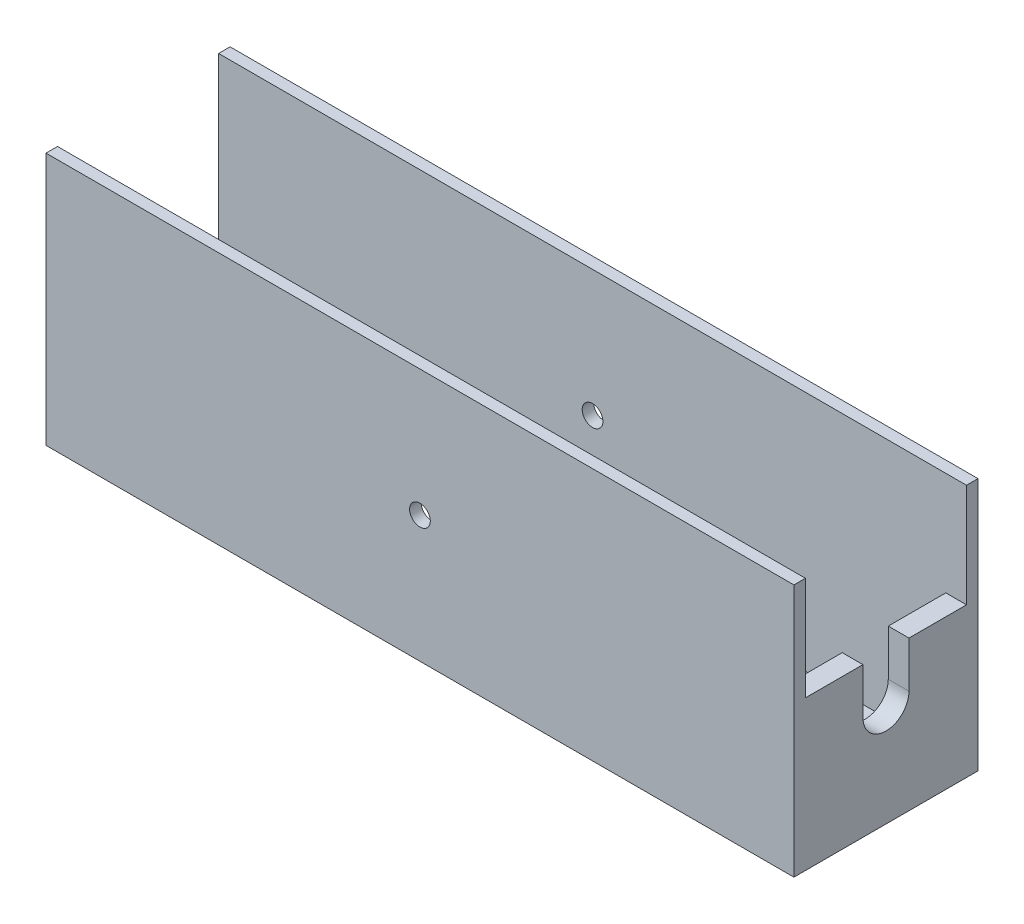
ISO-10303-21;
HEADER;
FILE_DESCRIPTION(('STEP AP214'),'2;1');
FILE_NAME('part.step','',(''),(''),'','','');
FILE_SCHEMA(('AUTOMOTIVE_DESIGN { 1 0 10303 214 1 1 1 1 }'));
ENDSEC;
DATA;
#1=APPLICATION_CONTEXT('core data for automotive mechanical design processes');
#2=APPLICATION_PROTOCOL_DEFINITION('international standard','automotive_design',2000,#1);
#3=PRODUCT_CONTEXT('',#1,'mechanical');
#4=PRODUCT('Part','Part','',(#3));
#5=PRODUCT_RELATED_PRODUCT_CATEGORY('part','',(#4));
#6=PRODUCT_DEFINITION_FORMATION('','',#4);
#7=PRODUCT_DEFINITION_CONTEXT('part definition',#1,'design');
#8=PRODUCT_DEFINITION('design','',#6,#7);
#9=PRODUCT_DEFINITION_SHAPE('','',#8);
#10=(LENGTH_UNIT() NAMED_UNIT(*) SI_UNIT(.MILLI.,.METRE.));
#11=(NAMED_UNIT(*) PLANE_ANGLE_UNIT() SI_UNIT($,.RADIAN.));
#12=(NAMED_UNIT(*) SI_UNIT($,.STERADIAN.) SOLID_ANGLE_UNIT());
#13=UNCERTAINTY_MEASURE_WITH_UNIT(LENGTH_MEASURE(1.E-05),#10,'distance_accuracy_value','');
#14=(GEOMETRIC_REPRESENTATION_CONTEXT(3) GLOBAL_UNCERTAINTY_ASSIGNED_CONTEXT((#13)) GLOBAL_UNIT_ASSIGNED_CONTEXT((#10,
#11,#12)) REPRESENTATION_CONTEXT('',''));
#15=CARTESIAN_POINT('',(0.,0.,0.));
#16=DIRECTION('',(0.,0.,1.));
#17=DIRECTION('',(1.,0.,0.));
#18=AXIS2_PLACEMENT_3D('',#15,#16,#17);
#19=CARTESIAN_POINT('',(0.,105.,0.));
#20=DIRECTION('',(0.,-1.,0.));
#21=DIRECTION('',(0.,0.,-1.));
#22=AXIS2_PLACEMENT_3D('',#19,#20,#21);
#23=PLANE('',#22);
#24=DIRECTION('',(-1.,0.,0.));
#25=VECTOR('',#24,1.);
#26=CARTESIAN_POINT('',(-150.609375415053,105.,-80.5076419213973));
#27=LINE('',#26,#25);
#28=CARTESIAN_POINT('',(162.5,105.,-80.5076419213973));
#29=VERTEX_POINT('',#28);
#30=CARTESIAN_POINT('',(-162.5,105.,-80.5076419213973));
#31=VERTEX_POINT('',#30);
#32=EDGE_CURVE('E48',#29,#31,#27,.T.);
#33=ORIENTED_EDGE('',*,*,#32,.F.);
#34=DIRECTION('',(0.,0.,1.));
#35=VECTOR('',#34,1.);
#36=CARTESIAN_POINT('',(162.5,105.,-85.5076419213973));
#37=LINE('',#36,#35);
#38=CARTESIAN_POINT('',(162.5,105.,-85.5076419213973));
#39=VERTEX_POINT('',#38);
#40=EDGE_CURVE('E238',#39,#29,#37,.T.);
#41=ORIENTED_EDGE('',*,*,#40,.F.);
#42=DIRECTION('',(1.,0.,0.));
#43=VECTOR('',#42,1.);
#44=CARTESIAN_POINT('',(-162.5,105.,-85.5076419213973));
#45=LINE('',#44,#43);
#46=CARTESIAN_POINT('',(-162.5,105.,-85.5076419213973));
#47=VERTEX_POINT('',#46);
#48=EDGE_CURVE('E234',#47,#39,#45,.T.);
#49=ORIENTED_EDGE('',*,*,#48,.F.);
#50=DIRECTION('',(0.,0.,-1.));
#51=VECTOR('',#50,1.);
#52=CARTESIAN_POINT('',(-162.5,105.,-80.5076419213973));
#53=LINE('',#52,#51);
#54=EDGE_CURVE('E230',#31,#47,#53,.T.);
#55=ORIENTED_EDGE('',*,*,#54,.F.);
#56=EDGE_LOOP('',(#33,#41,#49,#55));
#57=FACE_BOUND('',#56,.T.);
#58=ADVANCED_FACE('F33',(#57),#23,.F.);
#59=CARTESIAN_POINT('',(0.,0.,0.));
#60=DIRECTION('',(0.,-1.,0.));
#61=DIRECTION('',(0.,0.,-1.));
#62=AXIS2_PLACEMENT_3D('',#59,#60,#61);
#63=PLANE('',#62);
#64=DIRECTION('',(0.,0.,-1.));
#65=VECTOR('',#64,1.);
#66=CARTESIAN_POINT('',(-67.5,0.,-10.5076419213973));
#67=LINE('',#66,#65);
#68=CARTESIAN_POINT('',(-67.5,0.,-10.5076419213973));
#69=VERTEX_POINT('',#68);
#70=CARTESIAN_POINT('',(-67.5,0.,-80.5076419213973));
#71=VERTEX_POINT('',#70);
#72=EDGE_CURVE('E208',#69,#71,#67,.T.);
#73=ORIENTED_EDGE('',*,*,#72,.T.);
#74=DIRECTION('',(1.,0.,0.));
#75=VECTOR('',#74,1.);
#76=CARTESIAN_POINT('',(-150.609375415053,0.,-80.5076419213973));
#77=LINE('',#76,#75);
#78=CARTESIAN_POINT('',(-162.5,0.,-80.5076419213973));
#79=VERTEX_POINT('',#78);
#80=EDGE_CURVE('E231',#79,#71,#77,.T.);
#81=ORIENTED_EDGE('',*,*,#80,.F.);
#82=DIRECTION('',(0.,0.,1.));
#83=VECTOR('',#82,1.);
#84=CARTESIAN_POINT('',(-162.5,0.,-5.50764192139734));
#85=LINE('',#84,#83);
#86=CARTESIAN_POINT('',(-162.5,0.,-10.5076419213973));
#87=VERTEX_POINT('',#86);
#88=EDGE_CURVE('E261',#79,#87,#85,.T.);
#89=ORIENTED_EDGE('',*,*,#88,.T.);
#90=DIRECTION('',(1.,0.,0.));
#91=VECTOR('',#90,1.);
#92=CARTESIAN_POINT('',(-150.609375415053,0.,-10.5076419213973));
#93=LINE('',#92,#91);
#94=EDGE_CURVE('E250',#87,#69,#93,.T.);
#95=ORIENTED_EDGE('',*,*,#94,.T.);
#96=EDGE_LOOP('',(#73,#81,#89,#95));
#97=FACE_BOUND('',#96,.T.);
#98=ADVANCED_FACE('F352',(#97),#63,.F.);
#99=CARTESIAN_POINT('',(0.,-5.,0.));
#100=DIRECTION('',(0.,-1.,0.));
#101=DIRECTION('',(0.,0.,-1.));
#102=AXIS2_PLACEMENT_3D('',#99,#100,#101);
#103=PLANE('',#102);
#104=DIRECTION('',(0.,0.,-1.));
#105=VECTOR('',#104,1.);
#106=CARTESIAN_POINT('',(162.5,-5.,-5.50764192139734));
#107=LINE('',#106,#105);
#108=CARTESIAN_POINT('',(162.5,-5.,-5.50764192139734));
#109=VERTEX_POINT('',#108);
#110=CARTESIAN_POINT('',(162.5,-5.,-85.5076419213973));
#111=VERTEX_POINT('',#110);
#112=EDGE_CURVE('E268',#109,#111,#107,.T.);
#113=ORIENTED_EDGE('',*,*,#112,.F.);
#114=DIRECTION('',(1.,0.,0.));
#115=VECTOR('',#114,1.);
#116=CARTESIAN_POINT('',(-162.5,-5.,-5.50764192139734));
#117=LINE('',#116,#115);
#118=CARTESIAN_POINT('',(-162.5,-5.,-5.50764192139734));
#119=VERTEX_POINT('',#118);
#120=EDGE_CURVE('E277',#119,#109,#117,.T.);
#121=ORIENTED_EDGE('',*,*,#120,.F.);
#122=DIRECTION('',(0.,0.,1.));
#123=VECTOR('',#122,1.);
#124=CARTESIAN_POINT('',(-162.5,-5.,-5.50764192139734));
#125=LINE('',#124,#123);
#126=CARTESIAN_POINT('',(-162.5,-5.,-85.5076419213973));
#127=VERTEX_POINT('',#126);
#128=EDGE_CURVE('E274',#127,#119,#125,.T.);
#129=ORIENTED_EDGE('',*,*,#128,.F.);
#130=DIRECTION('',(-1.,0.,0.));
#131=VECTOR('',#130,1.);
#132=CARTESIAN_POINT('',(-162.5,-5.,-85.5076419213973));
#133=LINE('',#132,#131);
#134=EDGE_CURVE('E271',#111,#127,#133,.T.);
#135=ORIENTED_EDGE('',*,*,#134,.F.);
#136=EDGE_LOOP('',(#113,#121,#129,#135));
#137=FACE_BOUND('',#136,.T.);
#138=DIRECTION('',(0.,0.,1.));
#139=VECTOR('',#138,1.);
#140=CARTESIAN_POINT('',(52.5,-5.,0.));
#141=LINE('',#140,#139);
#142=CARTESIAN_POINT('',(52.5,-5.,-80.5076419213973));
#143=VERTEX_POINT('',#142);
#144=CARTESIAN_POINT('',(52.5,-5.,-10.5076419213973));
#145=VERTEX_POINT('',#144);
#146=EDGE_CURVE('E298',#143,#145,#141,.T.);
#147=ORIENTED_EDGE('',*,*,#146,.F.);
#148=DIRECTION('',(-1.,0.,0.));
#149=VECTOR('',#148,1.);
#150=CARTESIAN_POINT('',(0.,-5.,-80.5076419213973));
#151=LINE('',#150,#149);
#152=CARTESIAN_POINT('',(-67.5,-5.,-80.5076419213973));
#153=VERTEX_POINT('',#152);
#154=EDGE_CURVE('E300',#143,#153,#151,.T.);
#155=ORIENTED_EDGE('',*,*,#154,.T.);
#156=DIRECTION('',(0.,0.,1.));
#157=VECTOR('',#156,1.);
#158=CARTESIAN_POINT('',(-67.5,-5.,0.));
#159=LINE('',#158,#157);
#160=CARTESIAN_POINT('',(-67.5,-5.,-10.5076419213973));
#161=VERTEX_POINT('',#160);
#162=EDGE_CURVE('E286',#153,#161,#159,.T.);
#163=ORIENTED_EDGE('',*,*,#162,.T.);
#164=DIRECTION('',(-1.,0.,0.));
#165=VECTOR('',#164,1.);
#166=CARTESIAN_POINT('',(0.,-5.,-10.5076419213973));
#167=LINE('',#166,#165);
#168=EDGE_CURVE('E296',#145,#161,#167,.T.);
#169=ORIENTED_EDGE('',*,*,#168,.F.);
#170=EDGE_LOOP('',(#147,#155,#163,#169));
#171=FACE_BOUND('',#170,.T.);
#172=ADVANCED_FACE('F336',(#137,#171),#103,.T.);
#173=CARTESIAN_POINT('',(52.5,0.,-80.5076419213973));
#174=VERTEX_POINT('',#173);
#175=CARTESIAN_POINT('',(153.5,0.,-80.5076419213973));
#176=VERTEX_POINT('',#175);
#177=EDGE_CURVE('E256',#174,#176,#77,.T.);
#178=ORIENTED_EDGE('',*,*,#177,.F.);
#179=DIRECTION('',(0.,0.,-1.));
#180=VECTOR('',#179,1.);
#181=CARTESIAN_POINT('',(52.5,0.,-10.5076419213973));
#182=LINE('',#181,#180);
#183=CARTESIAN_POINT('',(52.5,0.,-10.5076419213973));
#184=VERTEX_POINT('',#183);
#185=EDGE_CURVE('E205',#184,#174,#182,.T.);
#186=ORIENTED_EDGE('',*,*,#185,.F.);
#187=CARTESIAN_POINT('',(153.5,0.,-10.5076419213973));
#188=VERTEX_POINT('',#187);
#189=EDGE_CURVE('E228',#184,#188,#93,.T.);
#190=ORIENTED_EDGE('',*,*,#189,.T.);
#191=DIRECTION('',(0.,0.,-1.));
#192=VECTOR('',#191,1.);
#193=CARTESIAN_POINT('',(153.5,0.,-10.5076419213973));
#194=LINE('',#193,#192);
#195=EDGE_CURVE('E253',#188,#176,#194,.T.);
#196=ORIENTED_EDGE('',*,*,#195,.T.);
#197=EDGE_LOOP('',(#178,#186,#190,#196));
#198=FACE_BOUND('',#197,.T.);
#199=ADVANCED_FACE('F364',(#198),#63,.F.);
#200=CARTESIAN_POINT('',(162.5,-5.,-5.50764192139734));
#201=DIRECTION('',(1.,0.,0.));
#202=DIRECTION('',(0.,0.,-1.));
#203=AXIS2_PLACEMENT_3D('',#200,#201,#202);
#204=PLANE('',#203);
#205=DIRECTION('',(0.,-1.,0.));
#206=VECTOR('',#205,1.);
#207=CARTESIAN_POINT('',(162.5,0.,-10.5076419213973));
#208=LINE('',#207,#206);
#209=CARTESIAN_POINT('',(162.5,105.,-10.5076419213973));
#210=VERTEX_POINT('',#209);
#211=CARTESIAN_POINT('',(162.5,60.,-10.5076419213973));
#212=VERTEX_POINT('',#211);
#213=EDGE_CURVE('E191',#210,#212,#208,.T.);
#214=ORIENTED_EDGE('',*,*,#213,.F.);
#215=CARTESIAN_POINT('',(162.5,105.,-5.50764192139734));
#216=VERTEX_POINT('',#215);
#217=EDGE_CURVE('E237',#210,#216,#37,.T.);
#218=ORIENTED_EDGE('',*,*,#217,.T.);
#219=DIRECTION('',(0.,1.,0.));
#220=VECTOR('',#219,1.);
#221=CARTESIAN_POINT('',(162.5,-5.,-5.50764192139734));
#222=LINE('',#221,#220);
#223=EDGE_CURVE('E283',#109,#216,#222,.T.);
#224=ORIENTED_EDGE('',*,*,#223,.F.);
#225=ORIENTED_EDGE('',*,*,#112,.T.);
#226=DIRECTION('',(0.,1.,0.));
#227=VECTOR('',#226,1.);
#228=CARTESIAN_POINT('',(162.5,-5.,-85.5076419213973));
#229=LINE('',#228,#227);
#230=EDGE_CURVE('E280',#111,#39,#229,.T.);
#231=ORIENTED_EDGE('',*,*,#230,.T.);
#232=ORIENTED_EDGE('',*,*,#40,.T.);
#233=DIRECTION('',(0.,-1.,0.));
#234=VECTOR('',#233,1.);
#235=CARTESIAN_POINT('',(162.5,0.,-80.5076419213973));
#236=LINE('',#235,#234);
#237=CARTESIAN_POINT('',(162.5,60.,-80.5076419213973));
#238=VERTEX_POINT('',#237);
#239=EDGE_CURVE('E186',#29,#238,#236,.T.);
#240=ORIENTED_EDGE('',*,*,#239,.T.);
#241=DIRECTION('',(0.,0.,-1.));
#242=VECTOR('',#241,1.);
#243=CARTESIAN_POINT('',(162.5,60.,0.));
#244=LINE('',#243,#242);
#245=CARTESIAN_POINT('',(162.5,60.,-55.5076419213974));
#246=VERTEX_POINT('',#245);
#247=EDGE_CURVE('E184',#246,#238,#244,.T.);
#248=ORIENTED_EDGE('',*,*,#247,.F.);
#249=DIRECTION('',(0.,-1.,0.));
#250=VECTOR('',#249,1.);
#251=CARTESIAN_POINT('',(162.5,0.,-55.5076419213974));
#252=LINE('',#251,#250);
#253=CARTESIAN_POINT('',(162.5,40.,-55.5076419213974));
#254=VERTEX_POINT('',#253);
#255=EDGE_CURVE('E163',#246,#254,#252,.T.);
#256=ORIENTED_EDGE('',*,*,#255,.T.);
#257=CARTESIAN_POINT('',(162.5,40.,-45.5076419213974));
#258=DIRECTION('',(1.,0.,0.));
#259=DIRECTION('',(0.,0.,-1.));
#260=AXIS2_PLACEMENT_3D('',#257,#258,#259);
#261=CIRCLE('',#260,10.);
#262=CARTESIAN_POINT('',(162.5,40.,-35.5076419213974));
#263=VERTEX_POINT('',#262);
#264=EDGE_CURVE('E173',#263,#254,#261,.T.);
#265=ORIENTED_EDGE('',*,*,#264,.F.);
#266=DIRECTION('',(0.,-1.,0.));
#267=VECTOR('',#266,1.);
#268=CARTESIAN_POINT('',(162.5,0.,-35.5076419213974));
#269=LINE('',#268,#267);
#270=CARTESIAN_POINT('',(162.5,60.,-35.5076419213974));
#271=VERTEX_POINT('',#270);
#272=EDGE_CURVE('E170',#271,#263,#269,.T.);
#273=ORIENTED_EDGE('',*,*,#272,.F.);
#274=EDGE_CURVE('E188',#212,#271,#244,.T.);
#275=ORIENTED_EDGE('',*,*,#274,.F.);
#276=EDGE_LOOP('',(#214,#218,#224,#225,#231,#232,#240,#248,#256,#265,#273,#275));
#277=FACE_BOUND('',#276,.T.);
#278=ADVANCED_FACE('F35',(#277),#204,.T.);
#279=CARTESIAN_POINT('',(-162.5,-5.,-5.50764192139734));
#280=DIRECTION('',(0.,0.,1.));
#281=DIRECTION('',(1.,0.,0.));
#282=AXIS2_PLACEMENT_3D('',#279,#280,#281);
#283=PLANE('',#282);
#284=CARTESIAN_POINT('',(0.,50.,-5.50764192139734));
#285=DIRECTION('',(0.,0.,1.));
#286=DIRECTION('',(1.,0.,0.));
#287=AXIS2_PLACEMENT_3D('',#284,#285,#286);
#288=CIRCLE('',#287,4.5);
#289=CARTESIAN_POINT('',(4.5,50.,-5.50764192139734));
#290=VERTEX_POINT('',#289);
#291=EDGE_CURVE('E225',#290,#290,#288,.T.);
#292=ORIENTED_EDGE('',*,*,#291,.F.);
#293=EDGE_LOOP('',(#292));
#294=FACE_BOUND('',#293,.T.);
#295=ORIENTED_EDGE('',*,*,#223,.T.);
#296=DIRECTION('',(1.,0.,0.));
#297=VECTOR('',#296,1.);
#298=CARTESIAN_POINT('',(-162.5,105.,-5.50764192139734));
#299=LINE('',#298,#297);
#300=CARTESIAN_POINT('',(-162.5,105.,-5.50764192139734));
#301=VERTEX_POINT('',#300);
#302=EDGE_CURVE('E241',#301,#216,#299,.T.);
#303=ORIENTED_EDGE('',*,*,#302,.F.);
#304=DIRECTION('',(0.,1.,0.));
#305=VECTOR('',#304,1.);
#306=CARTESIAN_POINT('',(-162.5,-5.,-5.50764192139734));
#307=LINE('',#306,#305);
#308=EDGE_CURVE('E287',#119,#301,#307,.T.);
#309=ORIENTED_EDGE('',*,*,#308,.F.);
#310=ORIENTED_EDGE('',*,*,#120,.T.);
#311=EDGE_LOOP('',(#295,#303,#309,#310));
#312=FACE_BOUND('',#311,.T.);
#313=ADVANCED_FACE('F331',(#294,#312),#283,.T.);
#314=CARTESIAN_POINT('',(-162.5,-5.,-5.50764192139734));
#315=DIRECTION('',(-1.,0.,0.));
#316=DIRECTION('',(0.,0.,1.));
#317=AXIS2_PLACEMENT_3D('',#314,#315,#316);
#318=PLANE('',#317);
#319=ORIENTED_EDGE('',*,*,#88,.F.);
#320=DIRECTION('',(0.,-1.,0.));
#321=VECTOR('',#320,1.);
#322=CARTESIAN_POINT('',(-162.5,105.,-80.5076419213973));
#323=LINE('',#322,#321);
#324=EDGE_CURVE('E249',#31,#79,#323,.T.);
#325=ORIENTED_EDGE('',*,*,#324,.F.);
#326=ORIENTED_EDGE('',*,*,#54,.T.);
#327=DIRECTION('',(0.,1.,0.));
#328=VECTOR('',#327,1.);
#329=CARTESIAN_POINT('',(-162.5,-5.,-85.5076419213973));
#330=LINE('',#329,#328);
#331=EDGE_CURVE('E289',#127,#47,#330,.T.);
#332=ORIENTED_EDGE('',*,*,#331,.F.);
#333=ORIENTED_EDGE('',*,*,#128,.T.);
#334=ORIENTED_EDGE('',*,*,#308,.T.);
#335=DIRECTION('',(0.,0.,1.));
#336=VECTOR('',#335,1.);
#337=CARTESIAN_POINT('',(-162.5,105.,-10.5076419213973));
#338=LINE('',#337,#336);
#339=CARTESIAN_POINT('',(-162.5,105.,-10.5076419213973));
#340=VERTEX_POINT('',#339);
#341=EDGE_CURVE('E244',#340,#301,#338,.T.);
#342=ORIENTED_EDGE('',*,*,#341,.F.);
#343=DIRECTION('',(0.,-1.,0.));
#344=VECTOR('',#343,1.);
#345=CARTESIAN_POINT('',(-162.5,105.,-10.5076419213973));
#346=LINE('',#345,#344);
#347=EDGE_CURVE('E264',#340,#87,#346,.T.);
#348=ORIENTED_EDGE('',*,*,#347,.T.);
#349=EDGE_LOOP('',(#319,#325,#326,#332,#333,#334,#342,#348));
#350=FACE_BOUND('',#349,.T.);
#351=ADVANCED_FACE('F345',(#350),#318,.T.);
#352=CARTESIAN_POINT('',(-162.5,-5.,-85.5076419213973));
#353=DIRECTION('',(0.,0.,-1.));
#354=DIRECTION('',(-1.,0.,0.));
#355=AXIS2_PLACEMENT_3D('',#352,#353,#354);
#356=PLANE('',#355);
#357=CARTESIAN_POINT('',(0.,50.,-85.5076419213973));
#358=DIRECTION('',(0.,0.,1.));
#359=DIRECTION('',(1.,0.,0.));
#360=AXIS2_PLACEMENT_3D('',#357,#358,#359);
#361=CIRCLE('',#360,4.5);
#362=CARTESIAN_POINT('',(4.5,50.,-85.5076419213973));
#363=VERTEX_POINT('',#362);
#364=EDGE_CURVE('E218',#363,#363,#361,.T.);
#365=ORIENTED_EDGE('',*,*,#364,.T.);
#366=EDGE_LOOP('',(#365));
#367=FACE_BOUND('',#366,.T.);
#368=ORIENTED_EDGE('',*,*,#331,.T.);
#369=ORIENTED_EDGE('',*,*,#48,.T.);
#370=ORIENTED_EDGE('',*,*,#230,.F.);
#371=ORIENTED_EDGE('',*,*,#134,.T.);
#372=EDGE_LOOP('',(#368,#369,#370,#371));
#373=FACE_BOUND('',#372,.T.);
#374=ADVANCED_FACE('F340',(#367,#373),#356,.T.);
#375=CARTESIAN_POINT('',(-150.609375415053,105.,-80.5076419213973));
#376=DIRECTION('',(0.,0.,-1.));
#377=DIRECTION('',(-1.,0.,0.));
#378=AXIS2_PLACEMENT_3D('',#375,#376,#377);
#379=PLANE('',#378);
#380=CARTESIAN_POINT('',(0.,50.,-80.5076419213973));
#381=DIRECTION('',(0.,0.,-1.));
#382=DIRECTION('',(-1.,0.,0.));
#383=AXIS2_PLACEMENT_3D('',#380,#381,#382);
#384=CIRCLE('',#383,4.5);
#385=CARTESIAN_POINT('',(-4.5,50.,-80.5076419213973));
#386=VERTEX_POINT('',#385);
#387=EDGE_CURVE('E222',#386,#386,#384,.T.);
#388=ORIENTED_EDGE('',*,*,#387,.T.);
#389=EDGE_LOOP('',(#388));
#390=FACE_BOUND('',#389,.T.);
#391=DIRECTION('',(0.,-1.,0.));
#392=VECTOR('',#391,1.);
#393=CARTESIAN_POINT('',(153.5,105.,-80.5076419213973));
#394=LINE('',#393,#392);
#395=CARTESIAN_POINT('',(153.5,60.,-80.5076419213973));
#396=VERTEX_POINT('',#395);
#397=EDGE_CURVE('E259',#396,#176,#394,.T.);
#398=ORIENTED_EDGE('',*,*,#397,.F.);
#399=DIRECTION('',(1.,0.,0.));
#400=VECTOR('',#399,1.);
#401=CARTESIAN_POINT('',(57.5,60.,-80.5076419213973));
#402=LINE('',#401,#400);
#403=EDGE_CURVE('E201',#396,#238,#402,.T.);
#404=ORIENTED_EDGE('',*,*,#403,.T.);
#405=ORIENTED_EDGE('',*,*,#239,.F.);
#406=ORIENTED_EDGE('',*,*,#32,.T.);
#407=ORIENTED_EDGE('',*,*,#324,.T.);
#408=ORIENTED_EDGE('',*,*,#80,.T.);
#409=DIRECTION('',(0.,1.,0.));
#410=VECTOR('',#409,1.);
#411=CARTESIAN_POINT('',(-67.5,-105.,-80.5076419213973));
#412=LINE('',#411,#410);
#413=EDGE_CURVE('E211',#153,#71,#412,.T.);
#414=ORIENTED_EDGE('',*,*,#413,.F.);
#415=ORIENTED_EDGE('',*,*,#154,.F.);
#416=DIRECTION('',(0.,1.,0.));
#417=VECTOR('',#416,1.);
#418=CARTESIAN_POINT('',(52.5,-105.,-80.5076419213973));
#419=LINE('',#418,#417);
#420=EDGE_CURVE('E216',#143,#174,#419,.T.);
#421=ORIENTED_EDGE('',*,*,#420,.T.);
#422=ORIENTED_EDGE('',*,*,#177,.T.);
#423=EDGE_LOOP('',(#398,#404,#405,#406,#407,#408,#414,#415,#421,#422));
#424=FACE_BOUND('',#423,.T.);
#425=ADVANCED_FACE('F349',(#390,#424),#379,.F.);
#426=CARTESIAN_POINT('',(153.5,105.,-10.5076419213973));
#427=DIRECTION('',(-1.,0.,0.));
#428=DIRECTION('',(0.,0.,1.));
#429=AXIS2_PLACEMENT_3D('',#426,#427,#428);
#430=PLANE('',#429);
#431=DIRECTION('',(0.,0.,1.));
#432=VECTOR('',#431,1.);
#433=CARTESIAN_POINT('',(153.5,60.,-10.5076419213973));
#434=LINE('',#433,#432);
#435=CARTESIAN_POINT('',(153.5,60.,-35.5076419213974));
#436=VERTEX_POINT('',#435);
#437=CARTESIAN_POINT('',(153.5,60.,-10.5076419213973));
#438=VERTEX_POINT('',#437);
#439=EDGE_CURVE('E196',#436,#438,#434,.T.);
#440=ORIENTED_EDGE('',*,*,#439,.F.);
#441=DIRECTION('',(0.,1.,0.));
#442=VECTOR('',#441,1.);
#443=CARTESIAN_POINT('',(153.5,105.,-35.5076419213974));
#444=LINE('',#443,#442);
#445=CARTESIAN_POINT('',(153.5,40.,-35.5076419213974));
#446=VERTEX_POINT('',#445);
#447=EDGE_CURVE('E11',#446,#436,#444,.T.);
#448=ORIENTED_EDGE('',*,*,#447,.F.);
#449=CARTESIAN_POINT('',(153.5,40.,-45.5076419213974));
#450=DIRECTION('',(-1.,0.,0.));
#451=DIRECTION('',(0.,0.,1.));
#452=AXIS2_PLACEMENT_3D('',#449,#450,#451);
#453=CIRCLE('',#452,10.);
#454=CARTESIAN_POINT('',(153.5,40.,-55.5076419213974));
#455=VERTEX_POINT('',#454);
#456=EDGE_CURVE('E41',#455,#446,#453,.T.);
#457=ORIENTED_EDGE('',*,*,#456,.F.);
#458=DIRECTION('',(0.,1.,0.));
#459=VECTOR('',#458,1.);
#460=CARTESIAN_POINT('',(153.5,105.,-55.5076419213974));
#461=LINE('',#460,#459);
#462=CARTESIAN_POINT('',(153.5,60.,-55.5076419213974));
#463=VERTEX_POINT('',#462);
#464=EDGE_CURVE('E166',#455,#463,#461,.T.);
#465=ORIENTED_EDGE('',*,*,#464,.T.);
#466=DIRECTION('',(0.,0.,1.));
#467=VECTOR('',#466,1.);
#468=CARTESIAN_POINT('',(153.5,60.,-10.5076419213973));
#469=LINE('',#468,#467);
#470=EDGE_CURVE('E304',#396,#463,#469,.T.);
#471=ORIENTED_EDGE('',*,*,#470,.F.);
#472=ORIENTED_EDGE('',*,*,#397,.T.);
#473=ORIENTED_EDGE('',*,*,#195,.F.);
#474=DIRECTION('',(0.,-1.,0.));
#475=VECTOR('',#474,1.);
#476=CARTESIAN_POINT('',(153.5,105.,-10.5076419213973));
#477=LINE('',#476,#475);
#478=EDGE_CURVE('E262',#438,#188,#477,.T.);
#479=ORIENTED_EDGE('',*,*,#478,.F.);
#480=EDGE_LOOP('',(#440,#448,#457,#465,#471,#472,#473,#479));
#481=FACE_BOUND('',#480,.T.);
#482=ADVANCED_FACE('F311',(#481),#430,.T.);
#483=CARTESIAN_POINT('',(-150.609375415053,105.,-10.5076419213973));
#484=DIRECTION('',(0.,0.,-1.));
#485=DIRECTION('',(-1.,0.,0.));
#486=AXIS2_PLACEMENT_3D('',#483,#484,#485);
#487=PLANE('',#486);
#488=DIRECTION('',(-1.,0.,0.));
#489=VECTOR('',#488,1.);
#490=CARTESIAN_POINT('',(-150.609375415053,105.,-10.5076419213973));
#491=LINE('',#490,#489);
#492=EDGE_CURVE('E247',#210,#340,#491,.T.);
#493=ORIENTED_EDGE('',*,*,#492,.F.);
#494=ORIENTED_EDGE('',*,*,#213,.T.);
#495=DIRECTION('',(1.,0.,0.));
#496=VECTOR('',#495,1.);
#497=CARTESIAN_POINT('',(57.5,60.,-10.5076419213973));
#498=LINE('',#497,#496);
#499=EDGE_CURVE('E199',#438,#212,#498,.T.);
#500=ORIENTED_EDGE('',*,*,#499,.F.);
#501=ORIENTED_EDGE('',*,*,#478,.T.);
#502=ORIENTED_EDGE('',*,*,#189,.F.);
#503=DIRECTION('',(0.,1.,0.));
#504=VECTOR('',#503,1.);
#505=CARTESIAN_POINT('',(52.5,-105.,-10.5076419213973));
#506=LINE('',#505,#504);
#507=EDGE_CURVE('E214',#145,#184,#506,.T.);
#508=ORIENTED_EDGE('',*,*,#507,.F.);
#509=ORIENTED_EDGE('',*,*,#168,.T.);
#510=DIRECTION('',(0.,1.,0.));
#511=VECTOR('',#510,1.);
#512=CARTESIAN_POINT('',(-67.5,-105.,-10.5076419213973));
#513=LINE('',#512,#511);
#514=EDGE_CURVE('E56',#161,#69,#513,.T.);
#515=ORIENTED_EDGE('',*,*,#514,.T.);
#516=ORIENTED_EDGE('',*,*,#94,.F.);
#517=ORIENTED_EDGE('',*,*,#347,.F.);
#518=EDGE_LOOP('',(#493,#494,#500,#501,#502,#508,#509,#515,#516,#517));
#519=FACE_BOUND('',#518,.T.);
#520=CARTESIAN_POINT('',(0.,50.,-10.5076419213973));
#521=DIRECTION('',(0.,0.,-1.));
#522=DIRECTION('',(-1.,0.,0.));
#523=AXIS2_PLACEMENT_3D('',#520,#521,#522);
#524=CIRCLE('',#523,4.5);
#525=CARTESIAN_POINT('',(-4.5,50.,-10.5076419213973));
#526=VERTEX_POINT('',#525);
#527=EDGE_CURVE('E221',#526,#526,#524,.T.);
#528=ORIENTED_EDGE('',*,*,#527,.F.);
#529=EDGE_LOOP('',(#528));
#530=FACE_BOUND('',#529,.T.);
#531=ADVANCED_FACE('F319',(#519,#530),#487,.T.);
#532=ORIENTED_EDGE('',*,*,#217,.F.);
#533=ORIENTED_EDGE('',*,*,#492,.T.);
#534=ORIENTED_EDGE('',*,*,#341,.T.);
#535=ORIENTED_EDGE('',*,*,#302,.T.);
#536=EDGE_LOOP('',(#532,#533,#534,#535));
#537=FACE_BOUND('',#536,.T.);
#538=ADVANCED_FACE('F327',(#537),#23,.F.);
#539=CARTESIAN_POINT('',(0.,50.,-85.5076419213973));
#540=DIRECTION('',(0.,0.,1.));
#541=DIRECTION('',(1.,0.,0.));
#542=AXIS2_PLACEMENT_3D('',#539,#540,#541);
#543=CYLINDRICAL_SURFACE('',#542,4.5);
#544=ORIENTED_EDGE('',*,*,#291,.T.);
#545=EDGE_LOOP('',(#544));
#546=FACE_BOUND('',#545,.T.);
#547=ORIENTED_EDGE('',*,*,#527,.T.);
#548=EDGE_LOOP('',(#547));
#549=FACE_BOUND('',#548,.T.);
#550=ADVANCED_FACE('F385',(#546,#549),#543,.F.);
#551=ORIENTED_EDGE('',*,*,#364,.F.);
#552=EDGE_LOOP('',(#551));
#553=FACE_BOUND('',#552,.T.);
#554=ORIENTED_EDGE('',*,*,#387,.F.);
#555=EDGE_LOOP('',(#554));
#556=FACE_BOUND('',#555,.T.);
#557=ADVANCED_FACE('F390',(#553,#556),#543,.F.);
#558=CARTESIAN_POINT('',(52.5,-105.,-10.5076419213973));
#559=DIRECTION('',(1.,0.,0.));
#560=DIRECTION('',(0.,0.,-1.));
#561=AXIS2_PLACEMENT_3D('',#558,#559,#560);
#562=PLANE('',#561);
#563=ORIENTED_EDGE('',*,*,#146,.T.);
#564=ORIENTED_EDGE('',*,*,#507,.T.);
#565=ORIENTED_EDGE('',*,*,#185,.T.);
#566=ORIENTED_EDGE('',*,*,#420,.F.);
#567=EDGE_LOOP('',(#563,#564,#565,#566));
#568=FACE_BOUND('',#567,.T.);
#569=ADVANCED_FACE('F360',(#568),#562,.F.);
#570=CARTESIAN_POINT('',(-67.5,-105.,-10.5076419213973));
#571=DIRECTION('',(1.,0.,0.));
#572=DIRECTION('',(0.,0.,-1.));
#573=AXIS2_PLACEMENT_3D('',#570,#571,#572);
#574=PLANE('',#573);
#575=ORIENTED_EDGE('',*,*,#413,.T.);
#576=ORIENTED_EDGE('',*,*,#72,.F.);
#577=ORIENTED_EDGE('',*,*,#514,.F.);
#578=ORIENTED_EDGE('',*,*,#162,.F.);
#579=EDGE_LOOP('',(#575,#576,#577,#578));
#580=FACE_BOUND('',#579,.T.);
#581=ADVANCED_FACE('F353',(#580),#574,.T.);
#582=CARTESIAN_POINT('',(57.5,40.,-45.5076419213974));
#583=DIRECTION('',(1.,0.,0.));
#584=DIRECTION('',(0.,0.,-1.));
#585=AXIS2_PLACEMENT_3D('',#582,#583,#584);
#586=CYLINDRICAL_SURFACE('',#585,10.);
#587=ORIENTED_EDGE('',*,*,#456,.T.);
#588=DIRECTION('',(1.,0.,0.));
#589=VECTOR('',#588,1.);
#590=CARTESIAN_POINT('',(57.5,40.,-35.5076419213974));
#591=LINE('',#590,#589);
#592=EDGE_CURVE('E176',#446,#263,#591,.T.);
#593=ORIENTED_EDGE('',*,*,#592,.T.);
#594=ORIENTED_EDGE('',*,*,#264,.T.);
#595=DIRECTION('',(1.,0.,0.));
#596=VECTOR('',#595,1.);
#597=CARTESIAN_POINT('',(57.5,40.,-55.5076419213974));
#598=LINE('',#597,#596);
#599=EDGE_CURVE('E158',#455,#254,#598,.T.);
#600=ORIENTED_EDGE('',*,*,#599,.F.);
#601=EDGE_LOOP('',(#587,#593,#594,#600));
#602=FACE_BOUND('',#601,.T.);
#603=ADVANCED_FACE('F174',(#602),#586,.F.);
#604=CARTESIAN_POINT('',(57.5,0.,-35.5076419213974));
#605=DIRECTION('',(0.,0.,1.));
#606=DIRECTION('',(1.,0.,0.));
#607=AXIS2_PLACEMENT_3D('',#604,#605,#606);
#608=PLANE('',#607);
#609=ORIENTED_EDGE('',*,*,#447,.T.);
#610=DIRECTION('',(1.,0.,0.));
#611=VECTOR('',#610,1.);
#612=CARTESIAN_POINT('',(57.5,60.,-35.5076419213974));
#613=LINE('',#612,#611);
#614=EDGE_CURVE('E197',#436,#271,#613,.T.);
#615=ORIENTED_EDGE('',*,*,#614,.T.);
#616=ORIENTED_EDGE('',*,*,#272,.T.);
#617=ORIENTED_EDGE('',*,*,#592,.F.);
#618=EDGE_LOOP('',(#609,#615,#616,#617));
#619=FACE_BOUND('',#618,.T.);
#620=ADVANCED_FACE('F308',(#619),#608,.F.);
#621=CARTESIAN_POINT('',(57.5,60.,0.));
#622=DIRECTION('',(0.,-1.,0.));
#623=DIRECTION('',(0.,0.,-1.));
#624=AXIS2_PLACEMENT_3D('',#621,#622,#623);
#625=PLANE('',#624);
#626=ORIENTED_EDGE('',*,*,#439,.T.);
#627=ORIENTED_EDGE('',*,*,#499,.T.);
#628=ORIENTED_EDGE('',*,*,#274,.T.);
#629=ORIENTED_EDGE('',*,*,#614,.F.);
#630=EDGE_LOOP('',(#626,#627,#628,#629));
#631=FACE_BOUND('',#630,.T.);
#632=ADVANCED_FACE('F316',(#631),#625,.F.);
#633=ORIENTED_EDGE('',*,*,#470,.T.);
#634=DIRECTION('',(1.,0.,0.));
#635=VECTOR('',#634,1.);
#636=CARTESIAN_POINT('',(57.5,60.,-55.5076419213974));
#637=LINE('',#636,#635);
#638=EDGE_CURVE('E169',#463,#246,#637,.T.);
#639=ORIENTED_EDGE('',*,*,#638,.T.);
#640=ORIENTED_EDGE('',*,*,#247,.T.);
#641=ORIENTED_EDGE('',*,*,#403,.F.);
#642=EDGE_LOOP('',(#633,#639,#640,#641));
#643=FACE_BOUND('',#642,.T.);
#644=ADVANCED_FACE('F367',(#643),#625,.F.);
#645=CARTESIAN_POINT('',(57.5,0.,-55.5076419213974));
#646=DIRECTION('',(0.,0.,1.));
#647=DIRECTION('',(1.,0.,0.));
#648=AXIS2_PLACEMENT_3D('',#645,#646,#647);
#649=PLANE('',#648);
#650=ORIENTED_EDGE('',*,*,#599,.T.);
#651=ORIENTED_EDGE('',*,*,#255,.F.);
#652=ORIENTED_EDGE('',*,*,#638,.F.);
#653=ORIENTED_EDGE('',*,*,#464,.F.);
#654=EDGE_LOOP('',(#650,#651,#652,#653));
#655=FACE_BOUND('',#654,.T.);
#656=ADVANCED_FACE('F160',(#655),#649,.T.);
#657=CLOSED_SHELL('',(#58,#98,#172,#199,#278,#313,#351,#374,#425,#482,#531,#538,#550,#557,#569,
#581,#603,#620,#632,#644,#656));
#658=MANIFOLD_SOLID_BREP('B2',#657);
#659=ADVANCED_BREP_SHAPE_REPRESENTATION('',(#18,#658),#14);
#660=SHAPE_DEFINITION_REPRESENTATION(#9,#659);
ENDSEC;
END-ISO-10303-21;
